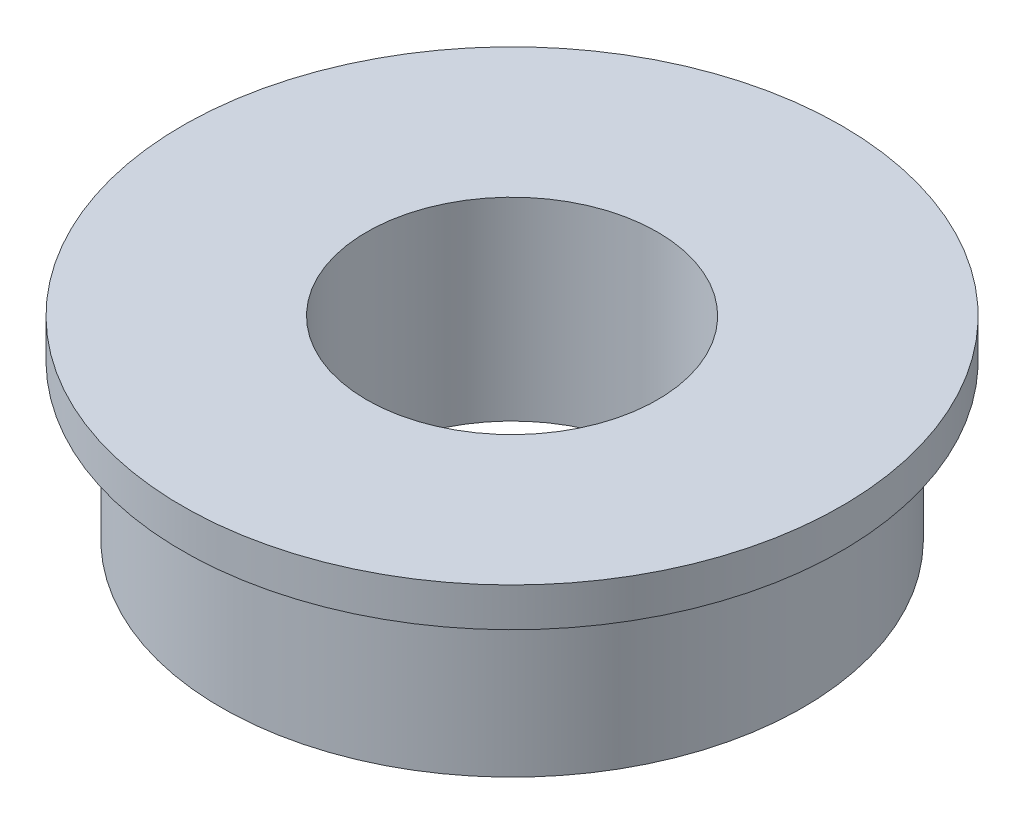
ISO-10303-21;
HEADER;
FILE_DESCRIPTION(('STEP AP214'),'2;1');
FILE_NAME('part.step','',(''),(''),'','','');
FILE_SCHEMA(('AUTOMOTIVE_DESIGN { 1 0 10303 214 1 1 1 1 }'));
ENDSEC;
DATA;
#1=APPLICATION_CONTEXT('core data for automotive mechanical design processes');
#2=APPLICATION_PROTOCOL_DEFINITION('international standard','automotive_design',2000,#1);
#3=PRODUCT_CONTEXT('',#1,'mechanical');
#4=PRODUCT('Part','Part','',(#3));
#5=PRODUCT_RELATED_PRODUCT_CATEGORY('part','',(#4));
#6=PRODUCT_DEFINITION_FORMATION('','',#4);
#7=PRODUCT_DEFINITION_CONTEXT('part definition',#1,'design');
#8=PRODUCT_DEFINITION('design','',#6,#7);
#9=PRODUCT_DEFINITION_SHAPE('','',#8);
#10=(LENGTH_UNIT() NAMED_UNIT(*) SI_UNIT(.MILLI.,.METRE.));
#11=(NAMED_UNIT(*) PLANE_ANGLE_UNIT() SI_UNIT($,.RADIAN.));
#12=(NAMED_UNIT(*) SI_UNIT($,.STERADIAN.) SOLID_ANGLE_UNIT());
#13=UNCERTAINTY_MEASURE_WITH_UNIT(LENGTH_MEASURE(1.E-05),#10,'distance_accuracy_value','');
#14=(GEOMETRIC_REPRESENTATION_CONTEXT(3) GLOBAL_UNCERTAINTY_ASSIGNED_CONTEXT((#13)) GLOBAL_UNIT_ASSIGNED_CONTEXT((#10,
#11,#12)) REPRESENTATION_CONTEXT('',''));
#15=CARTESIAN_POINT('',(0.,0.,0.));
#16=DIRECTION('',(0.,0.,1.));
#17=DIRECTION('',(1.,0.,0.));
#18=AXIS2_PLACEMENT_3D('',#15,#16,#17);
#19=CARTESIAN_POINT('',(6.,3.2,0.));
#20=DIRECTION('',(0.,-1.,0.));
#21=DIRECTION('',(0.,0.,-1.));
#22=AXIS2_PLACEMENT_3D('',#19,#20,#21);
#23=PLANE('',#22);
#24=CARTESIAN_POINT('',(0.,3.2,0.));
#25=DIRECTION('',(0.,-1.,0.));
#26=DIRECTION('',(0.,0.,-1.));
#27=AXIS2_PLACEMENT_3D('',#24,#25,#26);
#28=CIRCLE('',#27,6.8);
#29=CARTESIAN_POINT('',(0.,3.2,-6.8));
#30=VERTEX_POINT('',#29);
#31=EDGE_CURVE('E50',#30,#30,#28,.T.);
#32=ORIENTED_EDGE('',*,*,#31,.T.);
#33=EDGE_LOOP('',(#32));
#34=FACE_BOUND('',#33,.T.);
#35=CARTESIAN_POINT('',(0.,3.2,0.));
#36=DIRECTION('',(0.,-1.,0.));
#37=DIRECTION('',(0.,0.,-1.));
#38=AXIS2_PLACEMENT_3D('',#35,#36,#37);
#39=CIRCLE('',#38,6.);
#40=CARTESIAN_POINT('',(0.,3.2,-6.));
#41=VERTEX_POINT('',#40);
#42=EDGE_CURVE('E10',#41,#41,#39,.T.);
#43=ORIENTED_EDGE('',*,*,#42,.F.);
#44=EDGE_LOOP('',(#43));
#45=FACE_BOUND('',#44,.T.);
#46=ADVANCED_FACE('F28',(#34,#45),#23,.T.);
#47=CARTESIAN_POINT('',(0.,0.,0.));
#48=DIRECTION('',(0.,-1.,0.));
#49=DIRECTION('',(0.,0.,-1.));
#50=AXIS2_PLACEMENT_3D('',#47,#48,#49);
#51=CYLINDRICAL_SURFACE('',#50,6.);
#52=ORIENTED_EDGE('',*,*,#42,.T.);
#53=EDGE_LOOP('',(#52));
#54=FACE_BOUND('',#53,.T.);
#55=CARTESIAN_POINT('',(0.,0.,0.));
#56=DIRECTION('',(0.,-1.,0.));
#57=DIRECTION('',(0.,0.,-1.));
#58=AXIS2_PLACEMENT_3D('',#55,#56,#57);
#59=CIRCLE('',#58,6.);
#60=CARTESIAN_POINT('',(0.,0.,-6.));
#61=VERTEX_POINT('',#60);
#62=EDGE_CURVE('E34',#61,#61,#59,.T.);
#63=ORIENTED_EDGE('',*,*,#62,.F.);
#64=EDGE_LOOP('',(#63));
#65=FACE_BOUND('',#64,.T.);
#66=ADVANCED_FACE('F68',(#54,#65),#51,.T.);
#67=CARTESIAN_POINT('',(3.,0.,0.));
#68=DIRECTION('',(0.,-1.,0.));
#69=DIRECTION('',(0.,0.,-1.));
#70=AXIS2_PLACEMENT_3D('',#67,#68,#69);
#71=PLANE('',#70);
#72=ORIENTED_EDGE('',*,*,#62,.T.);
#73=EDGE_LOOP('',(#72));
#74=FACE_BOUND('',#73,.T.);
#75=CARTESIAN_POINT('',(0.,0.,0.));
#76=DIRECTION('',(0.,-1.,0.));
#77=DIRECTION('',(0.,0.,-1.));
#78=AXIS2_PLACEMENT_3D('',#75,#76,#77);
#79=CIRCLE('',#78,3.);
#80=CARTESIAN_POINT('',(0.,0.,-3.));
#81=VERTEX_POINT('',#80);
#82=EDGE_CURVE('E38',#81,#81,#79,.T.);
#83=ORIENTED_EDGE('',*,*,#82,.F.);
#84=EDGE_LOOP('',(#83));
#85=FACE_BOUND('',#84,.T.);
#86=ADVANCED_FACE('F72',(#74,#85),#71,.T.);
#87=CARTESIAN_POINT('',(0.,0.,0.));
#88=DIRECTION('',(0.,-1.,0.));
#89=DIRECTION('',(0.,0.,-1.));
#90=AXIS2_PLACEMENT_3D('',#87,#88,#89);
#91=CYLINDRICAL_SURFACE('',#90,3.);
#92=ORIENTED_EDGE('',*,*,#82,.T.);
#93=EDGE_LOOP('',(#92));
#94=FACE_BOUND('',#93,.T.);
#95=CARTESIAN_POINT('',(0.,4.,0.));
#96=DIRECTION('',(0.,-1.,0.));
#97=DIRECTION('',(0.,0.,-1.));
#98=AXIS2_PLACEMENT_3D('',#95,#96,#97);
#99=CIRCLE('',#98,3.);
#100=CARTESIAN_POINT('',(0.,4.,-3.));
#101=VERTEX_POINT('',#100);
#102=EDGE_CURVE('E42',#101,#101,#99,.T.);
#103=ORIENTED_EDGE('',*,*,#102,.F.);
#104=EDGE_LOOP('',(#103));
#105=FACE_BOUND('',#104,.T.);
#106=ADVANCED_FACE('F64',(#94,#105),#91,.F.);
#107=CARTESIAN_POINT('',(3.,4.,0.));
#108=DIRECTION('',(0.,1.,0.));
#109=DIRECTION('',(0.,0.,1.));
#110=AXIS2_PLACEMENT_3D('',#107,#108,#109);
#111=PLANE('',#110);
#112=ORIENTED_EDGE('',*,*,#102,.T.);
#113=EDGE_LOOP('',(#112));
#114=FACE_BOUND('',#113,.T.);
#115=CARTESIAN_POINT('',(0.,4.,0.));
#116=DIRECTION('',(0.,-1.,0.));
#117=DIRECTION('',(0.,0.,-1.));
#118=AXIS2_PLACEMENT_3D('',#115,#116,#117);
#119=CIRCLE('',#118,6.8);
#120=CARTESIAN_POINT('',(0.,4.,-6.8));
#121=VERTEX_POINT('',#120);
#122=EDGE_CURVE('E47',#121,#121,#119,.T.);
#123=ORIENTED_EDGE('',*,*,#122,.F.);
#124=EDGE_LOOP('',(#123));
#125=FACE_BOUND('',#124,.T.);
#126=ADVANCED_FACE('F58',(#114,#125),#111,.T.);
#127=CARTESIAN_POINT('',(0.,0.,0.));
#128=DIRECTION('',(0.,-1.,0.));
#129=DIRECTION('',(0.,0.,-1.));
#130=AXIS2_PLACEMENT_3D('',#127,#128,#129);
#131=CYLINDRICAL_SURFACE('',#130,6.8);
#132=ORIENTED_EDGE('',*,*,#122,.T.);
#133=EDGE_LOOP('',(#132));
#134=FACE_BOUND('',#133,.T.);
#135=ORIENTED_EDGE('',*,*,#31,.F.);
#136=EDGE_LOOP('',(#135));
#137=FACE_BOUND('',#136,.T.);
#138=ADVANCED_FACE('F56',(#134,#137),#131,.T.);
#139=CLOSED_SHELL('',(#46,#66,#86,#106,#126,#138));
#140=MANIFOLD_SOLID_BREP('B2',#139);
#141=ADVANCED_BREP_SHAPE_REPRESENTATION('',(#18,#140),#14);
#142=SHAPE_DEFINITION_REPRESENTATION(#9,#141);
ENDSEC;
END-ISO-10303-21;
